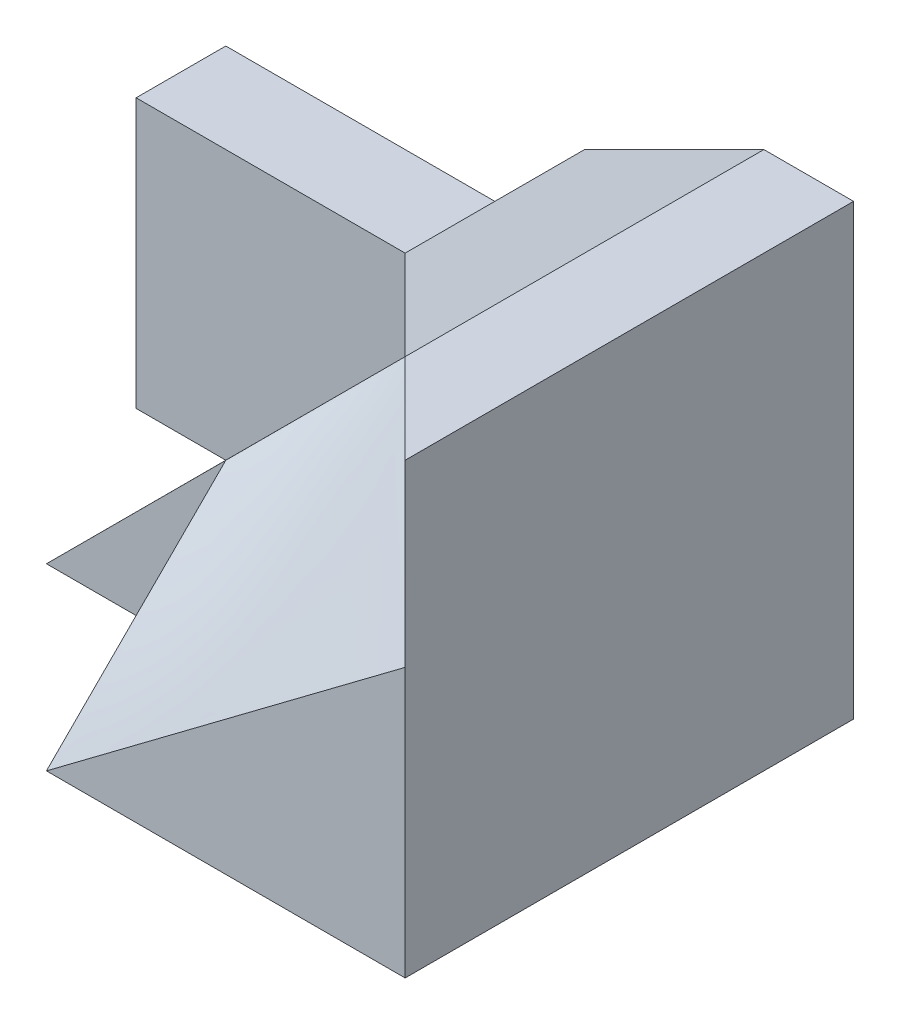
ISO-10303-21;
HEADER;
FILE_DESCRIPTION(('STEP AP214'),'2;1');
FILE_NAME('part.step','',(''),(''),'','','');
FILE_SCHEMA(('AUTOMOTIVE_DESIGN { 1 0 10303 214 1 1 1 1 }'));
ENDSEC;
DATA;
#1=APPLICATION_CONTEXT('core data for automotive mechanical design processes');
#2=APPLICATION_PROTOCOL_DEFINITION('international standard','automotive_design',2000,#1);
#3=PRODUCT_CONTEXT('',#1,'mechanical');
#4=PRODUCT('Part','Part','',(#3));
#5=PRODUCT_RELATED_PRODUCT_CATEGORY('part','',(#4));
#6=PRODUCT_DEFINITION_FORMATION('','',#4);
#7=PRODUCT_DEFINITION_CONTEXT('part definition',#1,'design');
#8=PRODUCT_DEFINITION('design','',#6,#7);
#9=PRODUCT_DEFINITION_SHAPE('','',#8);
#10=(LENGTH_UNIT() NAMED_UNIT(*) SI_UNIT(.MILLI.,.METRE.));
#11=(NAMED_UNIT(*) PLANE_ANGLE_UNIT() SI_UNIT($,.RADIAN.));
#12=(NAMED_UNIT(*) SI_UNIT($,.STERADIAN.) SOLID_ANGLE_UNIT());
#13=UNCERTAINTY_MEASURE_WITH_UNIT(LENGTH_MEASURE(1.E-05),#10,'distance_accuracy_value','');
#14=(GEOMETRIC_REPRESENTATION_CONTEXT(3) GLOBAL_UNCERTAINTY_ASSIGNED_CONTEXT((#13)) GLOBAL_UNIT_ASSIGNED_CONTEXT((#10,
#11,#12)) REPRESENTATION_CONTEXT('',''));
#15=CARTESIAN_POINT('',(0.,0.,0.));
#16=DIRECTION('',(0.,0.,1.));
#17=DIRECTION('',(1.,0.,0.));
#18=AXIS2_PLACEMENT_3D('',#15,#16,#17);
#19=CARTESIAN_POINT('',(0.,0.5,5.));
#20=DIRECTION('',(0.,0.,1.));
#21=DIRECTION('',(1.,0.,0.));
#22=AXIS2_PLACEMENT_3D('',#19,#20,#21);
#23=PLANE('',#22);
#24=DIRECTION('',(0.,1.,0.));
#25=VECTOR('',#24,1.);
#26=CARTESIAN_POINT('',(3.5,0.,5.));
#27=LINE('',#26,#25);
#28=CARTESIAN_POINT('',(3.5,-2.5,5.));
#29=VERTEX_POINT('',#28);
#30=CARTESIAN_POINT('',(3.5,0.499919162270091,5.));
#31=VERTEX_POINT('',#30);
#32=EDGE_CURVE('E138',#29,#31,#27,.T.);
#33=ORIENTED_EDGE('',*,*,#32,.T.);
#34=CARTESIAN_POINT('',(-0.500050717184653,-2.49992110660165,5.00006198767013));
#35=CARTESIAN_POINT('',(-0.333325194292877,-2.37500575282559,4.99999371430529));
#36=CARTESIAN_POINT('',(-0.166639415448993,-2.25003738826711,4.99996934489233));
#37=CARTESIAN_POINT('',(0.166706887768473,-2.00006137441089,4.99995147264532));
#38=CARTESIAN_POINT('',(0.333367411691634,-1.87505372451233,4.99995797030884));
#39=CARTESIAN_POINT('',(0.666711388498084,-1.62507041717143,4.99994488944603));
#40=CARTESIAN_POINT('',(0.833394841285314,-1.50009475960098,4.9999253110258));
#41=CARTESIAN_POINT('',(1.16673913401346,-1.25010991633136,4.99991291878284));
#42=CARTESIAN_POINT('',(1.33339997371916,-1.1251007303185,4.99992010521992));
#43=CARTESIAN_POINT('',(1.6666957122487,-0.875044715360976,4.99996474722783));
#44=CARTESIAN_POINT('',(1.83333061083001,-0.749997886093098,5.00000220306643));
#45=CARTESIAN_POINT('',(2.16664100514016,-0.499961906569062,5.00003039688357));
#46=CARTESIAN_POINT('',(2.33331650043458,-0.374972755733839,5.00002113534181));
#47=CARTESIAN_POINT('',(2.66663275377343,-0.124946569264944,5.0000418081665));
#48=CARTESIAN_POINT('',(2.83327351165744,9.04665826455199E-05,5.00007174271013));
#49=CARTESIAN_POINT('',(3.16660275893172,0.250090289923683,5.00007327363729));
#50=CARTESIAN_POINT('',(3.33329124671246,0.375053079563913,5.00004487179881));
#51=CARTESIAN_POINT('',(3.50005028549347,0.499921778121251,4.99993853995243));
#52=B_SPLINE_CURVE_WITH_KNOTS('',3,(#34,#35,#36,#37,#38,#39,#40,#41,#42,#43,#44,#45,#46,#47,#48,
#49,#50,#51),.UNSPECIFIED.,.F.,.F.,(4,2,2,2,2,2,2,2,4),(0.,0.624988945726933,1.24998796641358,
1.87498444388645,2.4999869883502,3.1249950616319,3.74999671732814,4.37500119844747,
4.99998663078848),.UNSPECIFIED.);
#53=CARTESIAN_POINT('',(-0.500012970350107,-2.49997982389984,5.00001585265013));
#54=VERTEX_POINT('',#53);
#55=EDGE_CURVE('E120',#31,#54,#52,.F.);
#56=ORIENTED_EDGE('',*,*,#55,.T.);
#57=DIRECTION('',(-1.,0.,0.));
#58=VECTOR('',#57,1.);
#59=CARTESIAN_POINT('',(0.,-2.5,5.));
#60=LINE('',#59,#58);
#61=EDGE_CURVE('E140',#29,#54,#60,.T.);
#62=ORIENTED_EDGE('',*,*,#61,.F.);
#63=EDGE_LOOP('',(#33,#56,#62));
#64=FACE_BOUND('',#63,.T.);
#65=ADVANCED_FACE('F35',(#64),#23,.T.);
#66=CARTESIAN_POINT('',(-0.5,0.5,0.));
#67=DIRECTION('',(-1.,0.,0.));
#68=DIRECTION('',(0.,0.,1.));
#69=AXIS2_PLACEMENT_3D('',#66,#67,#68);
#70=PLANE('',#69);
#71=DIRECTION('',(0.,0.,-1.));
#72=VECTOR('',#71,1.);
#73=CARTESIAN_POINT('',(-0.5,-2.5,0.));
#74=LINE('',#73,#72);
#75=CARTESIAN_POINT('',(-0.500000000000001,-2.5,3.));
#76=VERTEX_POINT('',#75);
#77=EDGE_CURVE('E230',#54,#76,#74,.T.);
#78=ORIENTED_EDGE('',*,*,#77,.F.);
#79=CARTESIAN_POINT('',(-0.499583481902302,-0.500647917040861,2.99949092232503));
#80=CARTESIAN_POINT('',(-0.500201531704146,-0.541407584325821,3.04196739461512));
#81=CARTESIAN_POINT('',(-0.5004064565023,-0.582743356234388,3.08387240207411));
#82=CARTESIAN_POINT('',(-0.500442138315094,-0.665996973565223,3.1672251355516));
#83=CARTESIAN_POINT('',(-0.500272352258052,-0.707915576205925,3.20867211025607));
#84=CARTESIAN_POINT('',(-0.500011530382429,-0.79164155077861,3.29167357961869));
#85=CARTESIAN_POINT('',(-0.499920492148622,-0.833448926082768,3.33322807094005));
#86=CARTESIAN_POINT('',(-0.499843324537032,-0.916903937512715,3.41646872789336));
#87=CARTESIAN_POINT('',(-0.499857158586875,-0.958551624258273,3.45815484255515));
#88=CARTESIAN_POINT('',(-0.499924337108398,-1.0834499857267,3.58323981102781));
#89=CARTESIAN_POINT('',(-0.500003355433785,-1.16666482353175,3.66667414418116));
#90=CARTESIAN_POINT('',(-0.500066665661404,-1.33323480090354,3.83341998329633));
#91=CARTESIAN_POINT('',(-0.500050947847869,-1.41658995398405,3.91673147578369));
#92=CARTESIAN_POINT('',(-0.500020930836353,-1.58330014709683,4.08335828830893));
#93=CARTESIAN_POINT('',(-0.500006631670936,-1.66665518708261,4.16667360839076));
#94=CARTESIAN_POINT('',(-0.499998326598673,-1.83333452401623,4.33332987567922));
#95=CARTESIAN_POINT('',(-0.500004320064535,-1.91665882183476,4.41667082201403));
#96=CARTESIAN_POINT('',(-0.500026399537599,-2.08329206359986,4.58336539564875));
#97=CARTESIAN_POINT('',(-0.500042485383903,-2.16660100777002,4.66671902272531));
#98=CARTESIAN_POINT('',(-0.500061891254585,-2.33323875415823,4.83341067430985));
#99=CARTESIAN_POINT('',(-0.500065210953332,-2.41656755682861,4.91674869836564));
#100=CARTESIAN_POINT('',(-0.500050717184655,-2.49992110660166,5.00006198767013));
#101=B_SPLINE_CURVE_WITH_KNOTS('',3,(#79,#80,#81,#82,#83,#84,#85,#86,#87,#88,#89,#90,#91,#92,
#93,#94,#95,#96,#97,#98,#99,#100),.UNSPECIFIED.,.F.,.F.,(4,2,2,2,2,2,2,2,2,2,4),(0.,
0.176588240743716,0.353432580398887,0.53027149597803,0.707048744920754,1.06056566025281,
1.41411883150989,1.76768011649719,2.12123047219234,2.4747751915891,2.82832892891783),.UNSPECIFIED.);
#102=CARTESIAN_POINT('',(-0.499976860105684,-0.500563558954222,2.99997686010568));
#103=VERTEX_POINT('',#102);
#104=EDGE_CURVE('E129',#54,#103,#101,.F.);
#105=ORIENTED_EDGE('',*,*,#104,.T.);
#106=DIRECTION('',(0.,-1.,0.));
#107=VECTOR('',#106,1.);
#108=CARTESIAN_POINT('',(-0.500000000000001,0.5,3.));
#109=LINE('',#108,#107);
#110=EDGE_CURVE('E154',#103,#76,#109,.T.);
#111=ORIENTED_EDGE('',*,*,#110,.T.);
#112=EDGE_LOOP('',(#78,#105,#111));
#113=FACE_BOUND('',#112,.T.);
#114=ADVANCED_FACE('F293',(#113),#70,.T.);
#115=CARTESIAN_POINT('',(-2.5,-2.5,6.));
#116=DIRECTION('',(-0.707106781186548,0.707106781186547,0.));
#117=DIRECTION('',(-0.707106781186547,-0.707106781186548,0.));
#118=AXIS2_PLACEMENT_3D('',#115,#116,#117);
#119=PLANE('',#118);
#120=DIRECTION('',(0.707106781186547,0.707106781186548,0.));
#121=VECTOR('',#120,1.);
#122=CARTESIAN_POINT('',(0.25,0.25,3.));
#123=LINE('',#122,#121);
#124=CARTESIAN_POINT('',(-2.5,-2.5,3.));
#125=VERTEX_POINT('',#124);
#126=EDGE_CURVE('E202',#125,#103,#123,.T.);
#127=ORIENTED_EDGE('',*,*,#126,.T.);
#128=CARTESIAN_POINT('',(0.499867318935816,0.500206392017341,2.00016216567997));
#129=CARTESIAN_POINT('',(0.458336761482517,0.458276931964024,2.04165803595066));
#130=CARTESIAN_POINT('',(0.416719422738383,0.416545629849929,2.08326546483653));
#131=CARTESIAN_POINT('',(0.333389795327423,0.333230716686934,2.16659637174732));
#132=CARTESIAN_POINT('',(0.291677469322402,0.291647190871531,2.20831989776882));
#133=CARTESIAN_POINT('',(0.208282190294649,0.208424650021934,2.29173019750772));
#134=CARTESIAN_POINT('',(0.166599235068301,0.166785640028042,2.33341697405863));
#135=CARTESIAN_POINT('',(0.0832886369042008,0.0834148923806888,2.41672234183288));
#136=CARTESIAN_POINT('',(0.0416609829102238,0.0416831799667249,2.4583409472686));
#137=CARTESIAN_POINT('',(-0.0415856813013599,-0.0418009469434818,2.54156696254987));
#138=CARTESIAN_POINT('',(-0.0832046914663385,-0.0835533615608138,2.58317437232769));
#139=CARTESIAN_POINT('',(-0.166550233964842,-0.166883237055382,2.66652127717436));
#140=CARTESIAN_POINT('',(-0.208276810962712,-0.208460595644391,2.70826082968604));
#141=CARTESIAN_POINT('',(-0.291860728745199,-0.291356369485901,2.79190458607209));
#142=CARTESIAN_POINT('',(-0.333718103989345,-0.332674706022677,2.83380883424732));
#143=CARTESIAN_POINT('',(-0.417034039727314,-0.415932547864742,2.9171298216284));
#144=CARTESIAN_POINT('',(-0.458493251060263,-0.457870573900207,2.95854739690026));
#145=CARTESIAN_POINT('',(-0.499583481902303,-0.500647917040862,2.99949092232503));
#146=B_SPLINE_CURVE_WITH_KNOTS('',3,(#128,#129,#130,#131,#132,#133,#134,#135,#136,#137,#138,
#139,#140,#141,#142,#143,#144,#145),.UNSPECIFIED.,.F.,.F.,(4,2,2,2,2,2,2,2,4),(0.,
0.216430645110189,0.432970595657283,0.64949205975286,0.86596043429536,1.08243009028142,
1.29901233272175,1.51565748003382,1.73184969041029),.UNSPECIFIED.);
#147=CARTESIAN_POINT('',(0.499999999999999,0.500177894826843,2.));
#148=VERTEX_POINT('',#147);
#149=EDGE_CURVE('E288',#103,#148,#146,.F.);
#150=ORIENTED_EDGE('',*,*,#149,.T.);
#151=DIRECTION('',(0.,0.,-1.));
#152=VECTOR('',#151,1.);
#153=CARTESIAN_POINT('',(0.499999999999999,0.5,5.));
#154=LINE('',#153,#152);
#155=CARTESIAN_POINT('',(0.499999999999999,0.5,1.));
#156=VERTEX_POINT('',#155);
#157=EDGE_CURVE('E11',#148,#156,#154,.T.);
#158=ORIENTED_EDGE('',*,*,#157,.T.);
#159=DIRECTION('',(0.707106781186547,0.707106781186548,0.));
#160=VECTOR('',#159,1.);
#161=CARTESIAN_POINT('',(-2.5,-2.5,1.));
#162=LINE('',#161,#160);
#163=CARTESIAN_POINT('',(-2.5,-2.5,1.));
#164=VERTEX_POINT('',#163);
#165=EDGE_CURVE('E231',#164,#156,#162,.T.);
#166=ORIENTED_EDGE('',*,*,#165,.F.);
#167=DIRECTION('',(0.,0.,1.));
#168=VECTOR('',#167,1.);
#169=CARTESIAN_POINT('',(-2.5,-2.5,0.));
#170=LINE('',#169,#168);
#171=EDGE_CURVE('E155',#164,#125,#170,.T.);
#172=ORIENTED_EDGE('',*,*,#171,.T.);
#173=EDGE_LOOP('',(#127,#150,#158,#166,#172));
#174=FACE_BOUND('',#173,.T.);
#175=ADVANCED_FACE('F253',(#174),#119,.T.);
#176=CARTESIAN_POINT('',(0.,0.5,3.));
#177=DIRECTION('',(0.,0.,-1.));
#178=DIRECTION('',(-1.,0.,0.));
#179=AXIS2_PLACEMENT_3D('',#176,#177,#178);
#180=PLANE('',#179);
#181=ORIENTED_EDGE('',*,*,#126,.F.);
#182=DIRECTION('',(1.,0.,0.));
#183=VECTOR('',#182,1.);
#184=CARTESIAN_POINT('',(0.,-2.5,3.));
#185=LINE('',#184,#183);
#186=EDGE_CURVE('E227',#125,#76,#185,.T.);
#187=ORIENTED_EDGE('',*,*,#186,.T.);
#188=ORIENTED_EDGE('',*,*,#110,.F.);
#189=EDGE_LOOP('',(#181,#187,#188));
#190=FACE_BOUND('',#189,.T.);
#191=ADVANCED_FACE('F300',(#190),#180,.F.);
#192=CARTESIAN_POINT('',(0.499999999999999,0.,5.));
#193=DIRECTION('',(1.,0.,0.));
#194=DIRECTION('',(0.,1.,0.));
#195=AXIS2_PLACEMENT_3D('',#192,#193,#194);
#196=PLANE('',#195);
#197=ORIENTED_EDGE('',*,*,#157,.F.);
#198=DIRECTION('',(0.,-1.,0.));
#199=VECTOR('',#198,1.);
#200=CARTESIAN_POINT('',(0.499999999999999,2.5,2.));
#201=LINE('',#200,#199);
#202=CARTESIAN_POINT('',(0.499999999999999,1.5,2.));
#203=VERTEX_POINT('',#202);
#204=EDGE_CURVE('E210',#203,#148,#201,.T.);
#205=ORIENTED_EDGE('',*,*,#204,.F.);
#206=DIRECTION('',(0.,0.,-1.));
#207=VECTOR('',#206,1.);
#208=CARTESIAN_POINT('',(0.499999999999999,1.5,5.));
#209=LINE('',#208,#207);
#210=CARTESIAN_POINT('',(0.499999999999999,1.5,0.));
#211=VERTEX_POINT('',#210);
#212=EDGE_CURVE('E55',#203,#211,#209,.T.);
#213=ORIENTED_EDGE('',*,*,#212,.T.);
#214=DIRECTION('',(0.,-1.,0.));
#215=VECTOR('',#214,1.);
#216=CARTESIAN_POINT('',(0.499999999999999,0.,0.));
#217=LINE('',#216,#215);
#218=CARTESIAN_POINT('',(0.499999999999999,0.5,0.));
#219=VERTEX_POINT('',#218);
#220=EDGE_CURVE('E175',#211,#219,#217,.T.);
#221=ORIENTED_EDGE('',*,*,#220,.T.);
#222=EDGE_CURVE('E47',#156,#219,#154,.T.);
#223=ORIENTED_EDGE('',*,*,#222,.F.);
#224=EDGE_LOOP('',(#197,#205,#213,#221,#223));
#225=FACE_BOUND('',#224,.T.);
#226=ADVANCED_FACE('F37',(#225),#196,.F.);
#227=CARTESIAN_POINT('',(0.499999999999999,2.5,1.));
#228=DIRECTION('',(0.,0.,1.));
#229=DIRECTION('',(1.,0.,0.));
#230=AXIS2_PLACEMENT_3D('',#227,#228,#229);
#231=PLANE('',#230);
#232=DIRECTION('',(-1.,0.,0.));
#233=VECTOR('',#232,1.);
#234=CARTESIAN_POINT('',(0.499999999999999,-2.5,1.));
#235=LINE('',#234,#233);
#236=CARTESIAN_POINT('',(-3.5,-2.5,0.999999999999999));
#237=VERTEX_POINT('',#236);
#238=EDGE_CURVE('E222',#164,#237,#235,.T.);
#239=ORIENTED_EDGE('',*,*,#238,.F.);
#240=ORIENTED_EDGE('',*,*,#165,.T.);
#241=DIRECTION('',(-1.,0.,0.));
#242=VECTOR('',#241,1.);
#243=CARTESIAN_POINT('',(0.,0.499999999999999,1.));
#244=LINE('',#243,#242);
#245=CARTESIAN_POINT('',(-3.5,0.499999999999999,0.999999999999999));
#246=VERTEX_POINT('',#245);
#247=EDGE_CURVE('E173',#156,#246,#244,.T.);
#248=ORIENTED_EDGE('',*,*,#247,.T.);
#249=DIRECTION('',(0.,-1.,0.));
#250=VECTOR('',#249,1.);
#251=CARTESIAN_POINT('',(-3.5,2.5,0.999999999999999));
#252=LINE('',#251,#250);
#253=EDGE_CURVE('E212',#246,#237,#252,.T.);
#254=ORIENTED_EDGE('',*,*,#253,.T.);
#255=EDGE_LOOP('',(#239,#240,#248,#254));
#256=FACE_BOUND('',#255,.T.);
#257=ADVANCED_FACE('F328',(#256),#231,.T.);
#258=CARTESIAN_POINT('',(3.5,2.5,5.));
#259=DIRECTION('',(-0.707106781186548,0.,0.707106781186548));
#260=DIRECTION('',(0.707106781186548,0.,0.707106781186548));
#261=AXIS2_PLACEMENT_3D('',#258,#259,#260);
#262=PLANE('',#261);
#263=ORIENTED_EDGE('',*,*,#204,.T.);
#264=CARTESIAN_POINT('',(0.535130428066525,0.499999999999998,2.03513042806653));
#265=CARTESIAN_POINT('',(0.533662516382879,0.500006471330715,2.03367176114105));
#266=CARTESIAN_POINT('',(0.532194433952418,0.500013183201513,2.03221326709744));
#267=CARTESIAN_POINT('',(0.52925794780167,0.500027106726085,2.02929667169608));
#268=CARTESIAN_POINT('',(0.527789544089454,0.500034318368483,2.02783857033015));
#269=CARTESIAN_POINT('',(0.524852403277402,0.500049260256345,2.02492277507219));
#270=CARTESIAN_POINT('',(0.523383666186207,0.500056990489623,2.02346508117139));
#271=CARTESIAN_POINT('',(0.520445846218365,0.500072988843872,2.02055011599533));
#272=CARTESIAN_POINT('',(0.518976763350958,0.500081256951805,2.01909284471068));
#273=CARTESIAN_POINT('',(0.516038239217566,0.500098350675426,2.01617874018246));
#274=CARTESIAN_POINT('',(0.514568797961447,0.500107176277187,2.01472190692886));
#275=CARTESIAN_POINT('',(0.511629544195446,0.500125404984991,2.01180869417401));
#276=CARTESIAN_POINT('',(0.510159731696081,0.50013480807618,2.01035231466206));
#277=CARTESIAN_POINT('',(0.507219722374203,0.500154212092193,2.00744002536305));
#278=CARTESIAN_POINT('',(0.505749525562883,0.500164213001197,2.0059841155646));
#279=CARTESIAN_POINT('',(0.502808734255561,0.500184833438117,2.0030727820243));
#280=CARTESIAN_POINT('',(0.501338139771458,0.500195452949206,2.00161735827033));
#281=CARTESIAN_POINT('',(0.499867319227645,0.500206392312549,2.00016216538843));
#282=B_SPLINE_CURVE_WITH_KNOTS('',3,(#264,#265,#266,#267,#268,#269,#270,#271,#272,#273,#274,
#275,#276,#277,#278,#279,#280,#281),.UNSPECIFIED.,.F.,.F.,(4,2,2,2,2,2,2,2,4),(0.,
0.00620827205675363,0.0124164028569905,0.018624387833635,0.0248322224041202,0.031039901976237,
0.0372474219542669,0.0434547777454019,0.0496619647664438),.UNSPECIFIED.);
#283=CARTESIAN_POINT('',(0.535130428066525,0.499999999999999,2.03513042806653));
#284=VERTEX_POINT('',#283);
#285=EDGE_CURVE('E233',#284,#148,#282,.T.);
#286=ORIENTED_EDGE('',*,*,#285,.F.);
#287=CARTESIAN_POINT('',(0.785670328446121,0.499999999999998,2.28567032844612));
#288=CARTESIAN_POINT('',(0.775238602385991,0.499988327458408,2.27522192732658));
#289=CARTESIAN_POINT('',(0.764807697125716,0.499975507850054,2.26477270834008));
#290=CARTESIAN_POINT('',(0.743946508585029,0.499948901108883,2.24387351016915));
#291=CARTESIAN_POINT('',(0.733516225309281,0.499935113969548,2.23342353098007));
#292=CARTESIAN_POINT('',(0.712655436676777,0.499907899014205,2.21252386383993));
#293=CARTESIAN_POINT('',(0.702224931320885,0.499894471196991,2.20207417588802));
#294=CARTESIAN_POINT('',(0.681362370360089,0.49987003885004,2.18117671157444));
#295=CARTESIAN_POINT('',(0.67093031478569,0.49985903427767,2.17072893518237));
#296=CARTESIAN_POINT('',(0.650062911636276,0.499842159632585,2.14983742539712));
#297=CARTESIAN_POINT('',(0.639627564195023,0.499836289372847,2.13939369187052));
#298=CARTESIAN_POINT('',(0.61875131941751,0.49983319442957,2.11851302574547));
#299=CARTESIAN_POINT('',(0.608310422452548,0.499835969226382,2.10807609277596));
#300=CARTESIAN_POINT('',(0.587420324757979,0.499854449991742,2.08721239617476));
#301=CARTESIAN_POINT('',(0.576971124845781,0.499870154814908,2.07678563172423));
#302=CARTESIAN_POINT('',(0.556060913085459,0.499919938311584,2.05594653924487));
#303=CARTESIAN_POINT('',(0.545599902824188,0.499954014755711,2.04553420961807));
#304=CARTESIAN_POINT('',(0.535130428066525,0.499999999999998,2.03513042806653));
#305=B_SPLINE_CURVE_WITH_KNOTS('',3,(#287,#288,#289,#290,#291,#292,#293,#294,#295,#296,#297,
#298,#299,#300,#301,#302,#303,#304),.UNSPECIFIED.,.F.,.F.,(4,2,2,2,2,2,2,2,4),(0.,
0.0442934661285126,0.088587230657804,0.132880846430859,0.177173682870814,0.221464905824864,
0.265753466509238,0.310038104394733,0.354317369577215),.UNSPECIFIED.);
#306=CARTESIAN_POINT('',(0.785670328446122,0.499999999999999,2.28567032844612));
#307=VERTEX_POINT('',#306);
#308=EDGE_CURVE('E134',#307,#284,#305,.T.);
#309=ORIENTED_EDGE('',*,*,#308,.F.);
#310=CARTESIAN_POINT('',(3.50005028549348,0.499921778121252,4.99993853995242));
#311=CARTESIAN_POINT('',(3.38698677970979,0.499874040360786,4.88680683736805));
#312=CARTESIAN_POINT('',(3.27388720392516,0.499876810051555,4.77371121828453));
#313=CARTESIAN_POINT('',(3.04766237927398,0.49992228531203,4.54755135829117));
#314=CARTESIAN_POINT('',(2.93453713112566,0.499964989876054,4.43448711666288));
#315=CARTESIAN_POINT('',(2.70830087028104,0.500029259851709,4.2083426700692));
#316=CARTESIAN_POINT('',(2.59518985769945,0.500050825102701,4.09526246498903));
#317=CARTESIAN_POINT('',(2.36898577882447,0.500066148310967,3.86908027641158));
#318=CARTESIAN_POINT('',(2.25589271286693,0.500059905797972,3.75597829257832));
#319=CARTESIAN_POINT('',(2.02972532389738,0.500018990178723,3.52975245272413));
#320=CARTESIAN_POINT('',(1.91665100116791,0.499984316677082,3.41662859642089));
#321=CARTESIAN_POINT('',(1.69049651822072,0.499924668346431,3.19038890157277));
#322=CARTESIAN_POINT('',(1.57741635807043,0.499899693423163,3.07727306296066));
#323=CARTESIAN_POINT('',(1.35120115171262,0.499931476360668,2.85110326079929));
#324=CARTESIAN_POINT('',(1.23806610730285,0.499988231704132,2.73804929545161));
#325=CARTESIAN_POINT('',(1.0118240435093,0.500058147582232,2.51190711148392));
#326=CARTESIAN_POINT('',(0.898717024981335,0.500071306918529,2.39881889200781));
#327=CARTESIAN_POINT('',(0.785670328446121,0.499999999999998,2.28567032844612));
#328=B_SPLINE_CURVE_WITH_KNOTS('',3,(#310,#311,#312,#313,#314,#315,#316,#317,#318,#319,#320,
#321,#322,#323,#324,#325,#326,#327),.UNSPECIFIED.,.F.,.F.,(4,2,2,2,2,2,2,2,4),(0.,
0.479832475907896,0.959652868493971,1.43947690721619,1.91930906044227,2.39914788674823,
2.87898204944186,3.35880143345414,3.83863400632833),.UNSPECIFIED.);
#329=EDGE_CURVE('E125',#31,#307,#328,.T.);
#330=ORIENTED_EDGE('',*,*,#329,.F.);
#331=CARTESIAN_POINT('',(3.5,2.5,5.));
#332=VERTEX_POINT('',#331);
#333=EDGE_CURVE('E145',#31,#332,#27,.T.);
#334=ORIENTED_EDGE('',*,*,#333,.T.);
#335=DIRECTION('',(-0.707106781186548,0.,-0.707106781186548));
#336=VECTOR('',#335,1.);
#337=CARTESIAN_POINT('',(3.5,2.5,5.));
#338=LINE('',#337,#336);
#339=CARTESIAN_POINT('',(2.5,2.5,4.));
#340=VERTEX_POINT('',#339);
#341=EDGE_CURVE('E216',#332,#340,#338,.T.);
#342=ORIENTED_EDGE('',*,*,#341,.T.);
#343=DIRECTION('',(-0.666666666666667,-0.333333333333333,-0.666666666666667));
#344=VECTOR('',#343,1.);
#345=CARTESIAN_POINT('',(1.27777777777778,1.88888888888889,2.77777777777778));
#346=LINE('',#345,#344);
#347=EDGE_CURVE('E211',#340,#203,#346,.T.);
#348=ORIENTED_EDGE('',*,*,#347,.T.);
#349=EDGE_LOOP('',(#263,#286,#309,#330,#334,#342,#348));
#350=FACE_BOUND('',#349,.T.);
#351=ADVANCED_FACE('F150',(#350),#262,.T.);
#352=CARTESIAN_POINT('',(0.,0.499999999999999,5.));
#353=DIRECTION('',(0.,-1.,0.));
#354=DIRECTION('',(1.,0.,0.));
#355=AXIS2_PLACEMENT_3D('',#352,#353,#354);
#356=PLANE('',#355);
#357=ORIENTED_EDGE('',*,*,#247,.F.);
#358=ORIENTED_EDGE('',*,*,#222,.T.);
#359=DIRECTION('',(-1.,0.,0.));
#360=VECTOR('',#359,1.);
#361=CARTESIAN_POINT('',(0.,0.499999999999999,0.));
#362=LINE('',#361,#360);
#363=CARTESIAN_POINT('',(-3.5,0.499999999999999,0.));
#364=VERTEX_POINT('',#363);
#365=EDGE_CURVE('E178',#219,#364,#362,.T.);
#366=ORIENTED_EDGE('',*,*,#365,.T.);
#367=DIRECTION('',(0.,0.,-1.));
#368=VECTOR('',#367,1.);
#369=CARTESIAN_POINT('',(-3.5,0.499999999999999,5.));
#370=LINE('',#369,#368);
#371=EDGE_CURVE('E198',#246,#364,#370,.T.);
#372=ORIENTED_EDGE('',*,*,#371,.F.);
#373=EDGE_LOOP('',(#357,#358,#366,#372));
#374=FACE_BOUND('',#373,.T.);
#375=ADVANCED_FACE('F333',(#374),#356,.F.);
#376=CARTESIAN_POINT('',(-3.5,0.,5.));
#377=DIRECTION('',(-1.,0.,0.));
#378=DIRECTION('',(0.,0.,1.));
#379=AXIS2_PLACEMENT_3D('',#376,#377,#378);
#380=PLANE('',#379);
#381=DIRECTION('',(0.,0.,-1.));
#382=VECTOR('',#381,1.);
#383=CARTESIAN_POINT('',(-3.5,-2.5,5.));
#384=LINE('',#383,#382);
#385=CARTESIAN_POINT('',(-3.5,-2.5,0.));
#386=VERTEX_POINT('',#385);
#387=EDGE_CURVE('E196',#237,#386,#384,.T.);
#388=ORIENTED_EDGE('',*,*,#387,.F.);
#389=ORIENTED_EDGE('',*,*,#253,.F.);
#390=ORIENTED_EDGE('',*,*,#371,.T.);
#391=DIRECTION('',(0.,1.,0.));
#392=VECTOR('',#391,1.);
#393=CARTESIAN_POINT('',(-3.5,0.,0.));
#394=LINE('',#393,#392);
#395=EDGE_CURVE('E181',#386,#364,#394,.T.);
#396=ORIENTED_EDGE('',*,*,#395,.F.);
#397=EDGE_LOOP('',(#388,#389,#390,#396));
#398=FACE_BOUND('',#397,.T.);
#399=ADVANCED_FACE('F366',(#398),#380,.T.);
#400=CARTESIAN_POINT('',(0.,-2.5,5.));
#401=DIRECTION('',(0.,1.,0.));
#402=DIRECTION('',(0.,0.,1.));
#403=AXIS2_PLACEMENT_3D('',#400,#401,#402);
#404=PLANE('',#403);
#405=ORIENTED_EDGE('',*,*,#171,.F.);
#406=ORIENTED_EDGE('',*,*,#238,.T.);
#407=ORIENTED_EDGE('',*,*,#387,.T.);
#408=DIRECTION('',(1.,0.,0.));
#409=VECTOR('',#408,1.);
#410=CARTESIAN_POINT('',(0.,-2.5,0.));
#411=LINE('',#410,#409);
#412=CARTESIAN_POINT('',(3.5,-2.5,0.));
#413=VERTEX_POINT('',#412);
#414=EDGE_CURVE('E184',#386,#413,#411,.T.);
#415=ORIENTED_EDGE('',*,*,#414,.T.);
#416=DIRECTION('',(0.,0.,-1.));
#417=VECTOR('',#416,1.);
#418=CARTESIAN_POINT('',(3.5,-2.5,5.));
#419=LINE('',#418,#417);
#420=EDGE_CURVE('E194',#29,#413,#419,.T.);
#421=ORIENTED_EDGE('',*,*,#420,.F.);
#422=ORIENTED_EDGE('',*,*,#61,.T.);
#423=ORIENTED_EDGE('',*,*,#77,.T.);
#424=ORIENTED_EDGE('',*,*,#186,.F.);
#425=EDGE_LOOP('',(#405,#406,#407,#415,#421,#422,#423,#424));
#426=FACE_BOUND('',#425,.T.);
#427=ADVANCED_FACE('F306',(#426),#404,.F.);
#428=CARTESIAN_POINT('',(0.,2.5,5.));
#429=DIRECTION('',(0.,1.,0.));
#430=DIRECTION('',(0.,0.,1.));
#431=AXIS2_PLACEMENT_3D('',#428,#429,#430);
#432=PLANE('',#431);
#433=DIRECTION('',(0.,0.,-1.));
#434=VECTOR('',#433,1.);
#435=CARTESIAN_POINT('',(2.5,2.5,5.));
#436=LINE('',#435,#434);
#437=CARTESIAN_POINT('',(2.5,2.5,0.));
#438=VERTEX_POINT('',#437);
#439=EDGE_CURVE('E191',#340,#438,#436,.T.);
#440=ORIENTED_EDGE('',*,*,#439,.F.);
#441=ORIENTED_EDGE('',*,*,#341,.F.);
#442=DIRECTION('',(0.,0.,-1.));
#443=VECTOR('',#442,1.);
#444=CARTESIAN_POINT('',(3.5,2.5,5.));
#445=LINE('',#444,#443);
#446=CARTESIAN_POINT('',(3.5,2.5,0.));
#447=VERTEX_POINT('',#446);
#448=EDGE_CURVE('E161',#332,#447,#445,.T.);
#449=ORIENTED_EDGE('',*,*,#448,.T.);
#450=DIRECTION('',(1.,0.,0.));
#451=VECTOR('',#450,1.);
#452=CARTESIAN_POINT('',(0.,2.5,0.));
#453=LINE('',#452,#451);
#454=EDGE_CURVE('E164',#438,#447,#453,.T.);
#455=ORIENTED_EDGE('',*,*,#454,.F.);
#456=EDGE_LOOP('',(#440,#441,#449,#455));
#457=FACE_BOUND('',#456,.T.);
#458=ADVANCED_FACE('F357',(#457),#432,.T.);
#459=CARTESIAN_POINT('',(-0.5,1.,5.));
#460=DIRECTION('',(0.447213595499958,-0.894427190999916,0.));
#461=DIRECTION('',(0.894427190999916,0.447213595499958,0.));
#462=AXIS2_PLACEMENT_3D('',#459,#460,#461);
#463=PLANE('',#462);
#464=ORIENTED_EDGE('',*,*,#347,.F.);
#465=ORIENTED_EDGE('',*,*,#439,.T.);
#466=DIRECTION('',(-0.894427190999916,-0.447213595499958,0.));
#467=VECTOR('',#466,1.);
#468=CARTESIAN_POINT('',(-0.5,1.,0.));
#469=LINE('',#468,#467);
#470=EDGE_CURVE('E162',#438,#211,#469,.T.);
#471=ORIENTED_EDGE('',*,*,#470,.T.);
#472=ORIENTED_EDGE('',*,*,#212,.F.);
#473=EDGE_LOOP('',(#464,#465,#471,#472));
#474=FACE_BOUND('',#473,.T.);
#475=ADVANCED_FACE('F354',(#474),#463,.F.);
#476=CARTESIAN_POINT('',(3.5,0.,5.));
#477=DIRECTION('',(-1.,0.,0.));
#478=DIRECTION('',(0.,0.,1.));
#479=AXIS2_PLACEMENT_3D('',#476,#477,#478);
#480=PLANE('',#479);
#481=DIRECTION('',(0.,1.,0.));
#482=VECTOR('',#481,1.);
#483=CARTESIAN_POINT('',(3.5,0.,0.));
#484=LINE('',#483,#482);
#485=EDGE_CURVE('E186',#413,#447,#484,.T.);
#486=ORIENTED_EDGE('',*,*,#485,.T.);
#487=ORIENTED_EDGE('',*,*,#448,.F.);
#488=ORIENTED_EDGE('',*,*,#333,.F.);
#489=ORIENTED_EDGE('',*,*,#32,.F.);
#490=ORIENTED_EDGE('',*,*,#420,.T.);
#491=EDGE_LOOP('',(#486,#487,#488,#489,#490));
#492=FACE_BOUND('',#491,.T.);
#493=ADVANCED_FACE('F160',(#492),#480,.F.);
#494=CARTESIAN_POINT('',(0.,0.,0.));
#495=DIRECTION('',(0.,0.,1.));
#496=DIRECTION('',(1.,0.,0.));
#497=AXIS2_PLACEMENT_3D('',#494,#495,#496);
#498=PLANE('',#497);
#499=ORIENTED_EDGE('',*,*,#220,.F.);
#500=ORIENTED_EDGE('',*,*,#470,.F.);
#501=ORIENTED_EDGE('',*,*,#454,.T.);
#502=ORIENTED_EDGE('',*,*,#485,.F.);
#503=ORIENTED_EDGE('',*,*,#414,.F.);
#504=ORIENTED_EDGE('',*,*,#395,.T.);
#505=ORIENTED_EDGE('',*,*,#365,.F.);
#506=EDGE_LOOP('',(#499,#500,#501,#502,#503,#504,#505));
#507=FACE_BOUND('',#506,.T.);
#508=ADVANCED_FACE('F252',(#507),#498,.F.);
#509=CARTESIAN_POINT('',(-0.526039928527821,-2.54892323088565,5.02934497455753));
#510=CARTESIAN_POINT('',(-0.650944644288698,-2.3795155572667,4.76838531352381));
#511=CARTESIAN_POINT('',(-0.785686142235555,-2.19480622246956,4.51944838627296));
#512=CARTESIAN_POINT('',(-0.930734615392888,-1.99406381512283,4.28310887316822));
#513=CARTESIAN_POINT('',(-1.17402535553562,-1.65420281387368,3.93911891643906));
#514=CARTESIAN_POINT('',(-1.44171216611659,-1.27639236972064,3.62494637913438));
#515=CARTESIAN_POINT('',(-1.53954541722809,-1.13791002273319,3.51679602721963));
#516=CARTESIAN_POINT('',(-1.74512553700062,-0.846410839319301,3.29787607498909));
#517=CARTESIAN_POINT('',(-1.95119603419137,-0.554148846588204,3.07955547293636));
#518=CARTESIAN_POINT('',(-2.05556635167101,-0.4063844231106,2.9646589767322));
#519=CARTESIAN_POINT('',(-2.15731475026285,-0.262698540125115,2.84655791299852));
#520=CARTESIAN_POINT('',(-2.25638844819715,-0.12317330260693,2.72518777068338));
#521=CARTESIAN_POINT('',(-0.328519491391827,-2.39970002573857,5.02977273369019));
#522=CARTESIAN_POINT('',(-0.447004234876745,-2.24027897566,4.76096643987475));
#523=CARTESIAN_POINT('',(-0.575084753293297,-2.06593116457668,4.50388831542018));
#524=CARTESIAN_POINT('',(-0.713060333400974,-1.87619103530718,4.25890415525476));
#525=CARTESIAN_POINT('',(-0.945027762099145,-1.55394407408288,3.90107459564893));
#526=CARTESIAN_POINT('',(-1.20226833481799,-1.19238333327091,3.57413443429055));
#527=CARTESIAN_POINT('',(-1.2965594216634,-1.05941101958625,3.46165477049503));
#528=CARTESIAN_POINT('',(-1.49533912221551,-0.778490266070793,3.23442319477287));
#529=CARTESIAN_POINT('',(-1.69450046569788,-0.496975845774928,3.00765807152103));
#530=CARTESIAN_POINT('',(-1.794854203836,-0.355459434606354,2.88785242278834));
#531=CARTESIAN_POINT('',(-1.8925520677217,-0.218074383385992,2.76480070552492));
#532=CARTESIAN_POINT('',(-1.98742302455468,-0.0850867431365095,2.63829387964151));
#533=CARTESIAN_POINT('',(-0.131404321457174,-2.24984640494496,5.03069581940226));
#534=CARTESIAN_POINT('',(-0.243538928128411,-2.10030334546545,4.75412824725899));
#535=CARTESIAN_POINT('',(-0.365242613710926,-1.93587505212397,4.48925621600728));
#536=CARTESIAN_POINT('',(-0.496191695270115,-1.75706503170765,4.23568411317149));
#537=CARTESIAN_POINT('',(-0.717094020877519,-1.452030453069,3.86433053867694));
#538=CARTESIAN_POINT('',(-0.963118025372492,-1.1079177072719,3.5236812383783));
#539=CARTESIAN_POINT('',(-1.054327426518,-0.97973912689823,3.40743506983844));
#540=CARTESIAN_POINT('',(-1.24639574708875,-0.709258297798141,3.17200069636133));
#541=CARTESIAN_POINT('',(-1.43714505155431,-0.440829271528487,2.9349541920889));
#542=CARTESIAN_POINT('',(-1.53484990436332,-0.303433348649597,2.81191101684289));
#543=CARTESIAN_POINT('',(-1.62785955798678,-0.173341068948275,2.6831292648145));
#544=CARTESIAN_POINT('',(-1.71851005884417,-0.0469185824386044,2.55146410384982));
#545=CARTESIAN_POINT('',(0.0658247885484965,-2.10017002426183,5.03147964502755));
#546=CARTESIAN_POINT('',(-0.0406400491137869,-1.95944660546292,4.74798235520666));
#547=CARTESIAN_POINT('',(-0.156065701785523,-1.80478414109374,4.47543717261955));
#548=CARTESIAN_POINT('',(-0.280248442114012,-1.63649954036965,4.21359509716846));
#549=CARTESIAN_POINT('',(-0.489630926643806,-1.34938471451835,3.82816171691241));
#550=CARTESIAN_POINT('',(-0.724366890094912,-1.02283114367839,3.4737159220046));
#551=CARTESIAN_POINT('',(-0.810871504319448,-0.901971120737266,3.35171945833914));
#552=CARTESIAN_POINT('',(-0.995380054835337,-0.643249933944888,3.107045365906));
#553=CARTESIAN_POINT('',(-1.18448053612757,-0.377385743722469,2.86798363331073));
#554=CARTESIAN_POINT('',(-1.27411330765381,-0.252546391727951,2.73507458094128));
#555=CARTESIAN_POINT('',(-1.36315854864334,-0.128620976123827,2.60144743569366));
#556=CARTESIAN_POINT('',(-1.44909416495319,-0.0095327544658757,2.46401963805977));
#557=CARTESIAN_POINT('',(0.490424134657943,-1.77900154176162,5.0326064173945));
#558=CARTESIAN_POINT('',(0.39459760353776,-1.65482659980597,4.73610675291104));
#559=CARTESIAN_POINT('',(0.291046578878374,-1.51863577901158,4.44904813608662));
#560=CARTESIAN_POINT('',(0.179429954460678,-1.36989846970424,4.17184747452235));
#561=CARTESIAN_POINT('',(-0.00573857317707309,-1.12044979901837,3.75681925806492));
#562=CARTESIAN_POINT('',(-0.213971803708036,-0.835122701609681,3.36998123403251));
#563=CARTESIAN_POINT('',(-0.289485601550691,-0.731359504151563,3.23455155034473));
#564=CARTESIAN_POINT('',(-0.47016056300573,-0.47860167812023,2.98519196017074));
#565=CARTESIAN_POINT('',(-0.628079121096068,-0.261242701767642,2.7080189881063));
#566=CARTESIAN_POINT('',(-0.71109314566166,-0.146699178378479,2.56702035611836));
#567=CARTESIAN_POINT('',(-0.790528799895715,-0.0377220088384344,2.42164816039182));
#568=CARTESIAN_POINT('',(-0.86702667662212,0.0666852845786108,2.27268534771149));
#569=CARTESIAN_POINT('',(0.915513003181717,-1.45859453857258,5.03313488458837));
#570=CARTESIAN_POINT('',(0.825586331070473,-1.34359715507529,4.72942428131622));
#571=CARTESIAN_POINT('',(0.728925813775054,-1.21812490129151,4.43394393326917));
#572=CARTESIAN_POINT('',(0.625937687199412,-1.0828096997385,4.14619732989795));
#573=CARTESIAN_POINT('',(0.455656241475856,-0.856518712030234,3.71297379110095));
#574=CARTESIAN_POINT('',(0.266894732016139,-0.601480958510182,3.30233699687036));
#575=CARTESIAN_POINT('',(0.195010181866802,-0.503363257463808,3.1624715660019));
#576=CARTESIAN_POINT('',(0.0561285817475131,-0.315617326843875,2.86203120086181));
#577=CARTESIAN_POINT('',(-0.0957187782185347,-0.107702436462139,2.57743787553456));
#578=CARTESIAN_POINT('',(-0.17116071095702,-0.00493772258187687,2.42718446464676));
#579=CARTESIAN_POINT('',(-0.241294210837626,0.0895694290750521,2.27044296915492));
#580=CARTESIAN_POINT('',(-0.307768936124044,0.178385153585465,2.10922963804796));
#581=CARTESIAN_POINT('',(1.14310826172072,-1.28745247165474,5.03320280390922));
#582=CARTESIAN_POINT('',(1.05452680170007,-1.17454764029838,4.72784805252634));
#583=CARTESIAN_POINT('',(0.959775389319524,-1.05204510527107,4.43003435402777));
#584=CARTESIAN_POINT('',(0.859082311198394,-0.920299979091746,4.13948269143437));
#585=CARTESIAN_POINT('',(0.692734945500775,-0.700128671423838,3.70145083260567));
#586=CARTESIAN_POINT('',(0.510749166928587,-0.45563094372882,3.28253258951255));
#587=CARTESIAN_POINT('',(0.445650584407443,-0.368069192326353,3.13437319820959));
#588=CARTESIAN_POINT('',(0.303540581705022,-0.175301302132531,2.837878658449));
#589=CARTESIAN_POINT('',(0.167554193898023,0.00794096489057221,2.53389970048282));
#590=CARTESIAN_POINT('',(0.100278686877299,0.098002349876583,2.37366510260669));
#591=CARTESIAN_POINT('',(0.0360602658370575,0.183308267781848,2.20969406630995));
#592=CARTESIAN_POINT('',(-0.0241604944506906,0.262395602294343,2.04083700020461));
#593=CARTESIAN_POINT('',(1.76106054961678,-0.823892946805115,5.03279668925677));
#594=CARTESIAN_POINT('',(1.67202489629521,-0.710281592536216,4.72799706301947));
#595=CARTESIAN_POINT('',(1.57803266221703,-0.58896000153484,4.42925547992911));
#596=CARTESIAN_POINT('',(1.47950005933112,-0.460575614610286,4.13606323649266));
#597=CARTESIAN_POINT('',(1.31750878113996,-0.247180443063546,3.69270727071162));
#598=CARTESIAN_POINT('',(1.14838211038189,-0.0226857719682688,3.25807234029014));
#599=CARTESIAN_POINT('',(1.08621980517835,0.0603084369401752,3.10632416559902));
#600=CARTESIAN_POINT('',(0.964717695308442,0.221019604950017,2.78464220126529));
#601=CARTESIAN_POINT('',(0.846502139739062,0.376618355159092,2.45894333723098));
#602=CARTESIAN_POINT('',(0.788693939257808,0.451952818861474,2.2871375869177));
#603=CARTESIAN_POINT('',(0.739318773923156,0.514169227891344,2.1050247936475));
#604=CARTESIAN_POINT('',(0.695501594091715,0.567739881694007,1.91611890698448));
#605=CARTESIAN_POINT('',(2.37948088960443,-0.361061502986839,5.03181851093685));
#606=CARTESIAN_POINT('',(2.28365823288001,-0.236892587869089,4.73531411108077));
#607=CARTESIAN_POINT('',(2.1839801314656,-0.106726314344659,4.44352192140137));
#608=CARTESIAN_POINT('',(2.0801896527426,0.0298369905486595,4.15675597065469));
#609=CARTESIAN_POINT('',(1.91378892816845,0.250091300913421,3.71878932823063));
#610=CARTESIAN_POINT('',(1.74579322762233,0.472826685012327,3.28277210088341));
#611=CARTESIAN_POINT('',(1.68773643381788,0.549434542855503,3.12600607892672));
#612=CARTESIAN_POINT('',(1.56612866937353,0.71031006242567,2.80445324796181));
#613=CARTESIAN_POINT('',(1.45544593532981,0.854191090261493,2.46954760206274));
#614=CARTESIAN_POINT('',(1.401610348271,0.92334593308452,2.29288643534426));
#615=CARTESIAN_POINT('',(1.34907751953942,0.990474262954116,2.11463300844804));
#616=CARTESIAN_POINT('',(1.29967304549247,1.05273626331426,1.93255603693727));
#617=CARTESIAN_POINT('',(2.77038394453033,-0.0694934181622026,5.03067711237937));
#618=CARTESIAN_POINT('',(2.67058698215084,0.0608577501968141,4.73903019721288));
#619=CARTESIAN_POINT('',(2.56769635617253,0.196021284153939,4.45116442644489));
#620=CARTESIAN_POINT('',(2.46209042579521,0.335408624954061,4.1666173610535));
#621=CARTESIAN_POINT('',(2.29406326931132,0.558192940511726,3.73063857985246));
#622=CARTESIAN_POINT('',(2.12750622170441,0.778690420038554,3.29286299891287));
#623=CARTESIAN_POINT('',(2.06793184361573,0.857658964546116,3.13795180219248));
#624=CARTESIAN_POINT('',(1.95062092502996,1.01185050166955,2.81114727073369));
#625=CARTESIAN_POINT('',(1.83824287913036,1.15836868128121,2.47831367265851));
#626=CARTESIAN_POINT('',(1.78265430972969,1.23025038552491,2.30379503991339));
#627=CARTESIAN_POINT('',(1.73111781491349,1.2958288626372,2.12432387156506));
#628=CARTESIAN_POINT('',(1.68252053469844,1.35683522814773,1.94126032981532));
#629=CARTESIAN_POINT('',(3.1602260155405,0.223725086087006,5.0308324719412));
#630=CARTESIAN_POINT('',(3.05828522329846,0.357411100898839,4.74180579327332));
#631=CARTESIAN_POINT('',(2.95376821360197,0.495104565084304,4.45592782482759));
#632=CARTESIAN_POINT('',(2.84640607220423,0.637223789693904,4.17352723957226));
#633=CARTESIAN_POINT('',(2.67763977638785,0.861157877546577,3.7384518508887));
#634=CARTESIAN_POINT('',(2.5105427958252,1.08249525278235,3.30133618800613));
#635=CARTESIAN_POINT('',(2.45220294938549,1.15954341472482,3.14491611927031));
#636=CARTESIAN_POINT('',(2.33323412484957,1.31631391665963,2.82013791730618));
#637=CARTESIAN_POINT('',(2.22180072967362,1.46136263959004,2.48614974612429));
#638=CARTESIAN_POINT('',(2.16668106607267,1.53251493481196,2.31105800629064));
#639=CARTESIAN_POINT('',(2.1141468948519,1.59964535299804,2.13280622021455));
#640=CARTESIAN_POINT('',(2.06435435650249,1.6625110089398,1.95120354951791));
#641=CARTESIAN_POINT('',(3.55095856631335,0.515558399594203,5.02989946734861));
#642=CARTESIAN_POINT('',(3.44720571644964,0.652063170706454,4.7430875257739));
#643=CARTESIAN_POINT('',(3.34098958095021,0.792399719474269,4.45928626664286));
#644=CARTESIAN_POINT('',(3.23264323354847,0.93604993120123,4.17808859983687));
#645=CARTESIAN_POINT('',(3.06273702042033,1.16175722376107,3.74440644342323));
#646=CARTESIAN_POINT('',(2.89551542893187,1.38328843821477,3.30744308278332));
#647=CARTESIAN_POINT('',(2.83682036519286,1.4608891604006,3.15145716852442));
#648=CARTESIAN_POINT('',(2.71807999787896,1.61730428443449,2.8263997410667));
#649=CARTESIAN_POINT('',(2.60600585861585,1.76334972038938,2.4931947015469));
#650=CARTESIAN_POINT('',(2.55048587911652,1.835124729231,2.31859223670016));
#651=CARTESIAN_POINT('',(2.49758148042968,1.90283105680875,2.14079295086038));
#652=CARTESIAN_POINT('',(2.44734909634835,1.96638091722238,1.95972786939163));
#653=B_SPLINE_SURFACE_WITH_KNOTS('',5,5,((#509,#510,#511,#512,#513,#514,#515,#516,#517,#518,
#519,#520),(#521,#522,#523,#524,#525,#526,#527,#528,#529,#530,#531,#532),(#533,#534,#535,#536,
#537,#538,#539,#540,#541,#542,#543,#544),(#545,#546,#547,#548,#549,#550,#551,#552,#553,#554,
#555,#556),(#557,#558,#559,#560,#561,#562,#563,#564,#565,#566,#567,#568),(#569,#570,#571,#572,
#573,#574,#575,#576,#577,#578,#579,#580),(#581,#582,#583,#584,#585,#586,#587,#588,#589,#590,
#591,#592),(#593,#594,#595,#596,#597,#598,#599,#600,#601,#602,#603,#604),(#605,#606,#607,#608,
#609,#610,#611,#612,#613,#614,#615,#616),(#617,#618,#619,#620,#621,#622,#623,#624,#625,#626,
#627,#628),(#629,#630,#631,#632,#633,#634,#635,#636,#637,#638,#639,#640),(#641,#642,#643,#644,
#645,#646,#647,#648,#649,#650,#651,#652)),.UNSPECIFIED.,.F.,.F.,.F.,(6,3,3,6),(6,3,3,6),
(-2.24558443654039,-1.01036234926707,0.410766333640676,2.84518045216679),(-1.5478559768719,
0.121108525500355,1.03997829682013,2.01830752970402),.UNSPECIFIED.);
#654=ORIENTED_EDGE('',*,*,#149,.F.);
#655=ORIENTED_EDGE('',*,*,#104,.F.);
#656=ORIENTED_EDGE('',*,*,#55,.F.);
#657=ORIENTED_EDGE('',*,*,#329,.T.);
#658=ORIENTED_EDGE('',*,*,#308,.T.);
#659=ORIENTED_EDGE('',*,*,#285,.T.);
#660=EDGE_LOOP('',(#654,#655,#656,#657,#658,#659));
#661=FACE_BOUND('',#660,.T.);
#662=ADVANCED_FACE('F123',(#661),#653,.T.);
#663=CLOSED_SHELL('',(#65,#114,#175,#191,#226,#257,#351,#375,#399,#427,#458,#475,#493,#508,#662));
#664=MANIFOLD_SOLID_BREP('B2',#663);
#665=ADVANCED_BREP_SHAPE_REPRESENTATION('',(#18,#664),#14);
#666=SHAPE_DEFINITION_REPRESENTATION(#9,#665);
ENDSEC;
END-ISO-10303-21;
